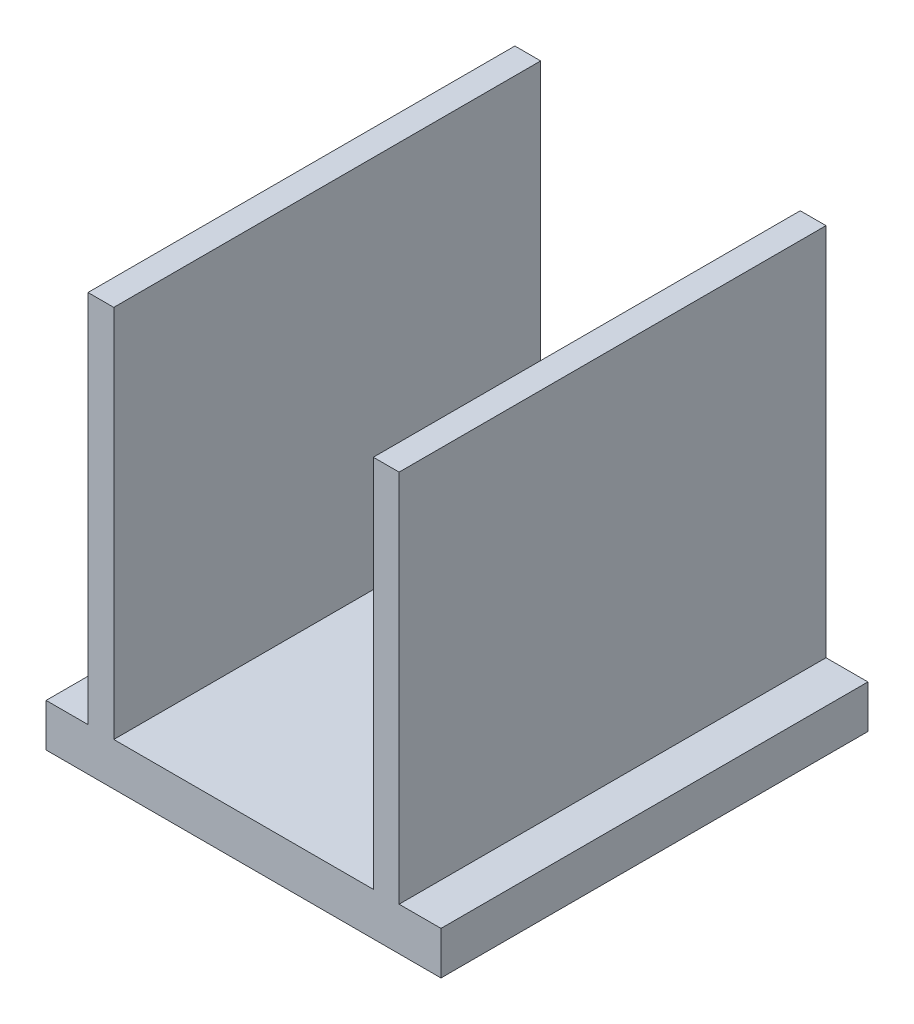
ISO-10303-21;
HEADER;
FILE_DESCRIPTION(('STEP AP214'),'2;1');
FILE_NAME('part.step','',(''),(''),'','','');
FILE_SCHEMA(('AUTOMOTIVE_DESIGN { 1 0 10303 214 1 1 1 1 }'));
ENDSEC;
DATA;
#1=APPLICATION_CONTEXT('core data for automotive mechanical design processes');
#2=APPLICATION_PROTOCOL_DEFINITION('international standard','automotive_design',2000,#1);
#3=PRODUCT_CONTEXT('',#1,'mechanical');
#4=PRODUCT('Part','Part','',(#3));
#5=PRODUCT_RELATED_PRODUCT_CATEGORY('part','',(#4));
#6=PRODUCT_DEFINITION_FORMATION('','',#4);
#7=PRODUCT_DEFINITION_CONTEXT('part definition',#1,'design');
#8=PRODUCT_DEFINITION('design','',#6,#7);
#9=PRODUCT_DEFINITION_SHAPE('','',#8);
#10=(LENGTH_UNIT() NAMED_UNIT(*) SI_UNIT(.MILLI.,.METRE.));
#11=(NAMED_UNIT(*) PLANE_ANGLE_UNIT() SI_UNIT($,.RADIAN.));
#12=(NAMED_UNIT(*) SI_UNIT($,.STERADIAN.) SOLID_ANGLE_UNIT());
#13=UNCERTAINTY_MEASURE_WITH_UNIT(LENGTH_MEASURE(1.E-05),#10,'distance_accuracy_value','');
#14=(GEOMETRIC_REPRESENTATION_CONTEXT(3) GLOBAL_UNCERTAINTY_ASSIGNED_CONTEXT((#13)) GLOBAL_UNIT_ASSIGNED_CONTEXT((#10,
#11,#12)) REPRESENTATION_CONTEXT('',''));
#15=CARTESIAN_POINT('',(0.,0.,0.));
#16=DIRECTION('',(0.,0.,1.));
#17=DIRECTION('',(1.,0.,0.));
#18=AXIS2_PLACEMENT_3D('',#15,#16,#17);
#19=CARTESIAN_POINT('',(0.,7.874,0.));
#20=DIRECTION('',(0.,-1.,0.));
#21=DIRECTION('',(0.,0.,-1.));
#22=AXIS2_PLACEMENT_3D('',#19,#20,#21);
#23=PLANE('',#22);
#24=DIRECTION('',(0.,0.,-1.));
#25=VECTOR('',#24,1.);
#26=CARTESIAN_POINT('',(45.9173385020541,7.874,0.));
#27=LINE('',#26,#25);
#28=CARTESIAN_POINT('',(45.9173385020541,7.874,18.1903176490572));
#29=VERTEX_POINT('',#28);
#30=CARTESIAN_POINT('',(45.9173385020541,7.874,-60.047607723232));
#31=VERTEX_POINT('',#30);
#32=EDGE_CURVE('E48',#29,#31,#27,.T.);
#33=ORIENTED_EDGE('',*,*,#32,.F.);
#34=DIRECTION('',(1.,0.,0.));
#35=VECTOR('',#34,1.);
#36=CARTESIAN_POINT('',(-18.7771020893495,7.874,18.1903176490572));
#37=LINE('',#36,#35);
#38=CARTESIAN_POINT('',(53.5929788800181,7.874,18.1903176490572));
#39=VERTEX_POINT('',#38);
#40=EDGE_CURVE('E146',#29,#39,#37,.T.);
#41=ORIENTED_EDGE('',*,*,#40,.T.);
#42=DIRECTION('',(0.,0.,-1.));
#43=VECTOR('',#42,1.);
#44=CARTESIAN_POINT('',(53.5929788800181,7.874,18.1903176490572));
#45=LINE('',#44,#43);
#46=CARTESIAN_POINT('',(53.5929788800181,7.874,-60.047607723232));
#47=VERTEX_POINT('',#46);
#48=EDGE_CURVE('E185',#39,#47,#45,.T.);
#49=ORIENTED_EDGE('',*,*,#48,.T.);
#50=DIRECTION('',(-1.,0.,0.));
#51=VECTOR('',#50,1.);
#52=CARTESIAN_POINT('',(-18.7771020893495,7.874,-60.047607723232));
#53=LINE('',#52,#51);
#54=EDGE_CURVE('E188',#47,#31,#53,.T.);
#55=ORIENTED_EDGE('',*,*,#54,.T.);
#56=EDGE_LOOP('',(#33,#41,#49,#55));
#57=FACE_BOUND('',#56,.T.);
#58=ADVANCED_FACE('F33',(#57),#23,.F.);
#59=CARTESIAN_POINT('',(-6.37614677656996,7.874,18.1903176490572));
#60=VERTEX_POINT('',#59);
#61=CARTESIAN_POINT('',(41.1920235672386,7.874,18.1903176490572));
#62=VERTEX_POINT('',#61);
#63=EDGE_CURVE('E56',#60,#62,#37,.T.);
#64=ORIENTED_EDGE('',*,*,#63,.T.);
#65=DIRECTION('',(0.,0.,-1.));
#66=VECTOR('',#65,1.);
#67=CARTESIAN_POINT('',(41.1920235672386,7.874,0.));
#68=LINE('',#67,#66);
#69=CARTESIAN_POINT('',(41.1920235672386,7.874,-60.047607723232));
#70=VERTEX_POINT('',#69);
#71=EDGE_CURVE('E142',#62,#70,#68,.T.);
#72=ORIENTED_EDGE('',*,*,#71,.T.);
#73=CARTESIAN_POINT('',(-6.37614677656996,7.874,-60.047607723232));
#74=VERTEX_POINT('',#73);
#75=EDGE_CURVE('E191',#70,#74,#53,.T.);
#76=ORIENTED_EDGE('',*,*,#75,.T.);
#77=DIRECTION('',(0.,0.,-1.));
#78=VECTOR('',#77,1.);
#79=CARTESIAN_POINT('',(-6.37614677656996,7.874,0.));
#80=LINE('',#79,#78);
#81=EDGE_CURVE('E147',#60,#74,#80,.T.);
#82=ORIENTED_EDGE('',*,*,#81,.F.);
#83=EDGE_LOOP('',(#64,#72,#76,#82));
#84=FACE_BOUND('',#83,.T.);
#85=ADVANCED_FACE('F225',(#84),#23,.F.);
#86=CARTESIAN_POINT('',(-18.7771020893495,7.874,18.1903176490572));
#87=DIRECTION('',(1.,0.,0.));
#88=DIRECTION('',(0.,0.,-1.));
#89=AXIS2_PLACEMENT_3D('',#86,#87,#88);
#90=PLANE('',#89);
#91=DIRECTION('',(0.,0.,1.));
#92=VECTOR('',#91,1.);
#93=CARTESIAN_POINT('',(-18.7771020893495,0.,18.1903176490572));
#94=LINE('',#93,#92);
#95=CARTESIAN_POINT('',(-18.7771020893495,0.,-60.047607723232));
#96=VERTEX_POINT('',#95);
#97=CARTESIAN_POINT('',(-18.7771020893495,0.,18.1903176490572));
#98=VERTEX_POINT('',#97);
#99=EDGE_CURVE('E177',#96,#98,#94,.T.);
#100=ORIENTED_EDGE('',*,*,#99,.T.);
#101=DIRECTION('',(0.,-1.,0.));
#102=VECTOR('',#101,1.);
#103=CARTESIAN_POINT('',(-18.7771020893495,7.874,18.1903176490572));
#104=LINE('',#103,#102);
#105=CARTESIAN_POINT('',(-18.7771020893495,7.874,18.1903176490572));
#106=VERTEX_POINT('',#105);
#107=EDGE_CURVE('E11',#106,#98,#104,.T.);
#108=ORIENTED_EDGE('',*,*,#107,.F.);
#109=DIRECTION('',(0.,0.,1.));
#110=VECTOR('',#109,1.);
#111=CARTESIAN_POINT('',(-18.7771020893495,7.874,18.1903176490572));
#112=LINE('',#111,#110);
#113=CARTESIAN_POINT('',(-18.7771020893495,7.874,-60.047607723232));
#114=VERTEX_POINT('',#113);
#115=EDGE_CURVE('E178',#114,#106,#112,.T.);
#116=ORIENTED_EDGE('',*,*,#115,.F.);
#117=DIRECTION('',(0.,-1.,0.));
#118=VECTOR('',#117,1.);
#119=CARTESIAN_POINT('',(-18.7771020893495,7.874,-60.047607723232));
#120=LINE('',#119,#118);
#121=EDGE_CURVE('E190',#114,#96,#120,.T.);
#122=ORIENTED_EDGE('',*,*,#121,.T.);
#123=EDGE_LOOP('',(#100,#108,#116,#122));
#124=FACE_BOUND('',#123,.T.);
#125=ADVANCED_FACE('F35',(#124),#90,.F.);
#126=CARTESIAN_POINT('',(-18.7771020893495,7.874,18.1903176490572));
#127=DIRECTION('',(0.,0.,-1.));
#128=DIRECTION('',(-1.,0.,0.));
#129=AXIS2_PLACEMENT_3D('',#126,#127,#128);
#130=PLANE('',#129);
#131=DIRECTION('',(1.,0.,0.));
#132=VECTOR('',#131,1.);
#133=CARTESIAN_POINT('',(-18.7771020893495,0.,18.1903176490572));
#134=LINE('',#133,#132);
#135=CARTESIAN_POINT('',(53.5929788800181,0.,18.1903176490572));
#136=VERTEX_POINT('',#135);
#137=EDGE_CURVE('E194',#98,#136,#134,.T.);
#138=ORIENTED_EDGE('',*,*,#137,.T.);
#139=DIRECTION('',(0.,-1.,0.));
#140=VECTOR('',#139,1.);
#141=CARTESIAN_POINT('',(53.5929788800181,7.874,18.1903176490572));
#142=LINE('',#141,#140);
#143=EDGE_CURVE('E41',#39,#136,#142,.T.);
#144=ORIENTED_EDGE('',*,*,#143,.F.);
#145=ORIENTED_EDGE('',*,*,#40,.F.);
#146=DIRECTION('',(0.,-1.,0.));
#147=VECTOR('',#146,1.);
#148=CARTESIAN_POINT('',(45.9173385020541,76.454,18.1903176490572));
#149=LINE('',#148,#147);
#150=CARTESIAN_POINT('',(45.9173385020541,76.454,18.1903176490572));
#151=VERTEX_POINT('',#150);
#152=EDGE_CURVE('E128',#151,#29,#149,.T.);
#153=ORIENTED_EDGE('',*,*,#152,.F.);
#154=DIRECTION('',(1.,0.,0.));
#155=VECTOR('',#154,1.);
#156=CARTESIAN_POINT('',(0.,76.454,18.1903176490572));
#157=LINE('',#156,#155);
#158=CARTESIAN_POINT('',(41.1920235672386,76.454,18.1903176490572));
#159=VERTEX_POINT('',#158);
#160=EDGE_CURVE('E134',#159,#151,#157,.T.);
#161=ORIENTED_EDGE('',*,*,#160,.F.);
#162=DIRECTION('',(0.,-1.,0.));
#163=VECTOR('',#162,1.);
#164=CARTESIAN_POINT('',(41.1920235672386,76.454,18.1903176490572));
#165=LINE('',#164,#163);
#166=EDGE_CURVE('E236',#159,#62,#165,.T.);
#167=ORIENTED_EDGE('',*,*,#166,.T.);
#168=ORIENTED_EDGE('',*,*,#63,.F.);
#169=DIRECTION('',(0.,-1.,0.));
#170=VECTOR('',#169,1.);
#171=CARTESIAN_POINT('',(-6.37614677656996,76.454,18.1903176490572));
#172=LINE('',#171,#170);
#173=CARTESIAN_POINT('',(-6.37614677656996,76.454,18.1903176490572));
#174=VERTEX_POINT('',#173);
#175=EDGE_CURVE('E165',#174,#60,#172,.T.);
#176=ORIENTED_EDGE('',*,*,#175,.F.);
#177=DIRECTION('',(1.,0.,0.));
#178=VECTOR('',#177,1.);
#179=CARTESIAN_POINT('',(0.,76.454,18.1903176490572));
#180=LINE('',#179,#178);
#181=CARTESIAN_POINT('',(-11.1014617113854,76.454,18.1903176490572));
#182=VERTEX_POINT('',#181);
#183=EDGE_CURVE('E164',#182,#174,#180,.T.);
#184=ORIENTED_EDGE('',*,*,#183,.F.);
#185=DIRECTION('',(0.,-1.,0.));
#186=VECTOR('',#185,1.);
#187=CARTESIAN_POINT('',(-11.1014617113854,76.454,18.1903176490572));
#188=LINE('',#187,#186);
#189=CARTESIAN_POINT('',(-11.1014617113854,7.874,18.1903176490572));
#190=VERTEX_POINT('',#189);
#191=EDGE_CURVE('E170',#182,#190,#188,.T.);
#192=ORIENTED_EDGE('',*,*,#191,.T.);
#193=EDGE_CURVE('E182',#106,#190,#37,.T.);
#194=ORIENTED_EDGE('',*,*,#193,.F.);
#195=ORIENTED_EDGE('',*,*,#107,.T.);
#196=EDGE_LOOP('',(#138,#144,#145,#153,#161,#167,#168,#176,#184,#192,#194,#195));
#197=FACE_BOUND('',#196,.T.);
#198=ADVANCED_FACE('F144',(#197),#130,.F.);
#199=CARTESIAN_POINT('',(53.5929788800181,7.874,18.1903176490572));
#200=DIRECTION('',(-1.,0.,0.));
#201=DIRECTION('',(0.,0.,1.));
#202=AXIS2_PLACEMENT_3D('',#199,#200,#201);
#203=PLANE('',#202);
#204=DIRECTION('',(0.,0.,-1.));
#205=VECTOR('',#204,1.);
#206=CARTESIAN_POINT('',(53.5929788800181,0.,18.1903176490572));
#207=LINE('',#206,#205);
#208=CARTESIAN_POINT('',(53.5929788800181,0.,-60.047607723232));
#209=VERTEX_POINT('',#208);
#210=EDGE_CURVE('E196',#136,#209,#207,.T.);
#211=ORIENTED_EDGE('',*,*,#210,.T.);
#212=DIRECTION('',(0.,-1.,0.));
#213=VECTOR('',#212,1.);
#214=CARTESIAN_POINT('',(53.5929788800181,7.874,-60.047607723232));
#215=LINE('',#214,#213);
#216=EDGE_CURVE('E201',#47,#209,#215,.T.);
#217=ORIENTED_EDGE('',*,*,#216,.F.);
#218=ORIENTED_EDGE('',*,*,#48,.F.);
#219=ORIENTED_EDGE('',*,*,#143,.T.);
#220=EDGE_LOOP('',(#211,#217,#218,#219));
#221=FACE_BOUND('',#220,.T.);
#222=ADVANCED_FACE('F207',(#221),#203,.F.);
#223=CARTESIAN_POINT('',(-18.7771020893495,7.874,-60.047607723232));
#224=DIRECTION('',(0.,0.,1.));
#225=DIRECTION('',(1.,0.,0.));
#226=AXIS2_PLACEMENT_3D('',#223,#224,#225);
#227=PLANE('',#226);
#228=DIRECTION('',(-1.,0.,0.));
#229=VECTOR('',#228,1.);
#230=CARTESIAN_POINT('',(-18.7771020893495,0.,-60.047607723232));
#231=LINE('',#230,#229);
#232=EDGE_CURVE('E181',#209,#96,#231,.T.);
#233=ORIENTED_EDGE('',*,*,#232,.T.);
#234=ORIENTED_EDGE('',*,*,#121,.F.);
#235=CARTESIAN_POINT('',(-11.1014617113854,7.874,-60.047607723232));
#236=VERTEX_POINT('',#235);
#237=EDGE_CURVE('E187',#236,#114,#53,.T.);
#238=ORIENTED_EDGE('',*,*,#237,.F.);
#239=DIRECTION('',(0.,-1.,0.));
#240=VECTOR('',#239,1.);
#241=CARTESIAN_POINT('',(-11.1014617113854,76.454,-60.047607723232));
#242=LINE('',#241,#240);
#243=CARTESIAN_POINT('',(-11.1014617113854,76.454,-60.047607723232));
#244=VERTEX_POINT('',#243);
#245=EDGE_CURVE('E172',#244,#236,#242,.T.);
#246=ORIENTED_EDGE('',*,*,#245,.F.);
#247=DIRECTION('',(-1.,0.,0.));
#248=VECTOR('',#247,1.);
#249=CARTESIAN_POINT('',(0.,76.454,-60.047607723232));
#250=LINE('',#249,#248);
#251=CARTESIAN_POINT('',(-6.37614677656996,76.454,-60.047607723232));
#252=VERTEX_POINT('',#251);
#253=EDGE_CURVE('E159',#252,#244,#250,.T.);
#254=ORIENTED_EDGE('',*,*,#253,.F.);
#255=DIRECTION('',(0.,-1.,0.));
#256=VECTOR('',#255,1.);
#257=CARTESIAN_POINT('',(-6.37614677656996,76.454,-60.047607723232));
#258=LINE('',#257,#256);
#259=EDGE_CURVE('E174',#252,#74,#258,.T.);
#260=ORIENTED_EDGE('',*,*,#259,.T.);
#261=ORIENTED_EDGE('',*,*,#75,.F.);
#262=DIRECTION('',(0.,-1.,0.));
#263=VECTOR('',#262,1.);
#264=CARTESIAN_POINT('',(41.1920235672386,76.454,-60.047607723232));
#265=LINE('',#264,#263);
#266=CARTESIAN_POINT('',(41.1920235672386,76.454,-60.047607723232));
#267=VERTEX_POINT('',#266);
#268=EDGE_CURVE('E152',#267,#70,#265,.T.);
#269=ORIENTED_EDGE('',*,*,#268,.F.);
#270=DIRECTION('',(-1.,0.,0.));
#271=VECTOR('',#270,1.);
#272=CARTESIAN_POINT('',(0.,76.454,-60.047607723232));
#273=LINE('',#272,#271);
#274=CARTESIAN_POINT('',(45.9173385020541,76.454,-60.047607723232));
#275=VERTEX_POINT('',#274);
#276=EDGE_CURVE('E133',#275,#267,#273,.T.);
#277=ORIENTED_EDGE('',*,*,#276,.F.);
#278=DIRECTION('',(0.,-1.,0.));
#279=VECTOR('',#278,1.);
#280=CARTESIAN_POINT('',(45.9173385020541,76.454,-60.047607723232));
#281=LINE('',#280,#279);
#282=EDGE_CURVE('E130',#275,#31,#281,.T.);
#283=ORIENTED_EDGE('',*,*,#282,.T.);
#284=ORIENTED_EDGE('',*,*,#54,.F.);
#285=ORIENTED_EDGE('',*,*,#216,.T.);
#286=EDGE_LOOP('',(#233,#234,#238,#246,#254,#260,#261,#269,#277,#283,#284,#285));
#287=FACE_BOUND('',#286,.T.);
#288=ADVANCED_FACE('F215',(#287),#227,.F.);
#289=ORIENTED_EDGE('',*,*,#193,.T.);
#290=DIRECTION('',(0.,0.,-1.));
#291=VECTOR('',#290,1.);
#292=CARTESIAN_POINT('',(-11.1014617113854,7.874,0.));
#293=LINE('',#292,#291);
#294=EDGE_CURVE('E150',#190,#236,#293,.T.);
#295=ORIENTED_EDGE('',*,*,#294,.T.);
#296=ORIENTED_EDGE('',*,*,#237,.T.);
#297=ORIENTED_EDGE('',*,*,#115,.T.);
#298=EDGE_LOOP('',(#289,#295,#296,#297));
#299=FACE_BOUND('',#298,.T.);
#300=ADVANCED_FACE('F222',(#299),#23,.F.);
#301=CARTESIAN_POINT('',(0.,0.,0.));
#302=DIRECTION('',(0.,-1.,0.));
#303=DIRECTION('',(0.,0.,-1.));
#304=AXIS2_PLACEMENT_3D('',#301,#302,#303);
#305=PLANE('',#304);
#306=ORIENTED_EDGE('',*,*,#99,.F.);
#307=ORIENTED_EDGE('',*,*,#232,.F.);
#308=ORIENTED_EDGE('',*,*,#210,.F.);
#309=ORIENTED_EDGE('',*,*,#137,.F.);
#310=EDGE_LOOP('',(#306,#307,#308,#309));
#311=FACE_BOUND('',#310,.T.);
#312=ADVANCED_FACE('F212',(#311),#305,.T.);
#313=CARTESIAN_POINT('',(-6.37614677656996,76.454,0.));
#314=DIRECTION('',(-1.,0.,0.));
#315=DIRECTION('',(0.,0.,1.));
#316=AXIS2_PLACEMENT_3D('',#313,#314,#315);
#317=PLANE('',#316);
#318=ORIENTED_EDGE('',*,*,#81,.T.);
#319=ORIENTED_EDGE('',*,*,#259,.F.);
#320=DIRECTION('',(0.,0.,-1.));
#321=VECTOR('',#320,1.);
#322=CARTESIAN_POINT('',(-6.37614677656996,76.454,0.));
#323=LINE('',#322,#321);
#324=EDGE_CURVE('E156',#174,#252,#323,.T.);
#325=ORIENTED_EDGE('',*,*,#324,.F.);
#326=ORIENTED_EDGE('',*,*,#175,.T.);
#327=EDGE_LOOP('',(#318,#319,#325,#326));
#328=FACE_BOUND('',#327,.T.);
#329=ADVANCED_FACE('F232',(#328),#317,.F.);
#330=CARTESIAN_POINT('',(-11.1014617113854,76.454,0.));
#331=DIRECTION('',(-1.,0.,0.));
#332=DIRECTION('',(0.,0.,1.));
#333=AXIS2_PLACEMENT_3D('',#330,#331,#332);
#334=PLANE('',#333);
#335=ORIENTED_EDGE('',*,*,#294,.F.);
#336=ORIENTED_EDGE('',*,*,#191,.F.);
#337=DIRECTION('',(0.,0.,-1.));
#338=VECTOR('',#337,1.);
#339=CARTESIAN_POINT('',(-11.1014617113854,76.454,0.));
#340=LINE('',#339,#338);
#341=EDGE_CURVE('E161',#182,#244,#340,.T.);
#342=ORIENTED_EDGE('',*,*,#341,.T.);
#343=ORIENTED_EDGE('',*,*,#245,.T.);
#344=EDGE_LOOP('',(#335,#336,#342,#343));
#345=FACE_BOUND('',#344,.T.);
#346=ADVANCED_FACE('F310',(#345),#334,.T.);
#347=CARTESIAN_POINT('',(0.,76.454,0.));
#348=DIRECTION('',(0.,1.,0.));
#349=DIRECTION('',(0.,0.,1.));
#350=AXIS2_PLACEMENT_3D('',#347,#348,#349);
#351=PLANE('',#350);
#352=ORIENTED_EDGE('',*,*,#324,.T.);
#353=ORIENTED_EDGE('',*,*,#253,.T.);
#354=ORIENTED_EDGE('',*,*,#341,.F.);
#355=ORIENTED_EDGE('',*,*,#183,.T.);
#356=EDGE_LOOP('',(#352,#353,#354,#355));
#357=FACE_BOUND('',#356,.T.);
#358=ADVANCED_FACE('F251',(#357),#351,.T.);
#359=CARTESIAN_POINT('',(45.9173385020541,76.454,0.));
#360=DIRECTION('',(-1.,0.,0.));
#361=DIRECTION('',(0.,0.,1.));
#362=AXIS2_PLACEMENT_3D('',#359,#360,#361);
#363=PLANE('',#362);
#364=ORIENTED_EDGE('',*,*,#32,.T.);
#365=ORIENTED_EDGE('',*,*,#282,.F.);
#366=DIRECTION('',(0.,0.,-1.));
#367=VECTOR('',#366,1.);
#368=CARTESIAN_POINT('',(45.9173385020541,76.454,0.));
#369=LINE('',#368,#367);
#370=EDGE_CURVE('E124',#151,#275,#369,.T.);
#371=ORIENTED_EDGE('',*,*,#370,.F.);
#372=ORIENTED_EDGE('',*,*,#152,.T.);
#373=EDGE_LOOP('',(#364,#365,#371,#372));
#374=FACE_BOUND('',#373,.T.);
#375=ADVANCED_FACE('F126',(#374),#363,.F.);
#376=CARTESIAN_POINT('',(41.1920235672386,76.454,0.));
#377=DIRECTION('',(-1.,0.,0.));
#378=DIRECTION('',(0.,0.,1.));
#379=AXIS2_PLACEMENT_3D('',#376,#377,#378);
#380=PLANE('',#379);
#381=ORIENTED_EDGE('',*,*,#71,.F.);
#382=ORIENTED_EDGE('',*,*,#166,.F.);
#383=DIRECTION('',(0.,0.,-1.));
#384=VECTOR('',#383,1.);
#385=CARTESIAN_POINT('',(41.1920235672386,76.454,0.));
#386=LINE('',#385,#384);
#387=EDGE_CURVE('E140',#159,#267,#386,.T.);
#388=ORIENTED_EDGE('',*,*,#387,.T.);
#389=ORIENTED_EDGE('',*,*,#268,.T.);
#390=EDGE_LOOP('',(#381,#382,#388,#389));
#391=FACE_BOUND('',#390,.T.);
#392=ADVANCED_FACE('F243',(#391),#380,.T.);
#393=CARTESIAN_POINT('',(0.,76.454,0.));
#394=DIRECTION('',(0.,1.,0.));
#395=DIRECTION('',(0.,0.,1.));
#396=AXIS2_PLACEMENT_3D('',#393,#394,#395);
#397=PLANE('',#396);
#398=ORIENTED_EDGE('',*,*,#160,.T.);
#399=ORIENTED_EDGE('',*,*,#370,.T.);
#400=ORIENTED_EDGE('',*,*,#276,.T.);
#401=ORIENTED_EDGE('',*,*,#387,.F.);
#402=EDGE_LOOP('',(#398,#399,#400,#401));
#403=FACE_BOUND('',#402,.T.);
#404=ADVANCED_FACE('F138',(#403),#397,.T.);
#405=CLOSED_SHELL('',(#58,#85,#125,#198,#222,#288,#300,#312,#329,#346,#358,#375,#392,#404));
#406=MANIFOLD_SOLID_BREP('B2',#405);
#407=ADVANCED_BREP_SHAPE_REPRESENTATION('',(#18,#406),#14);
#408=SHAPE_DEFINITION_REPRESENTATION(#9,#407);
ENDSEC;
END-ISO-10303-21;
